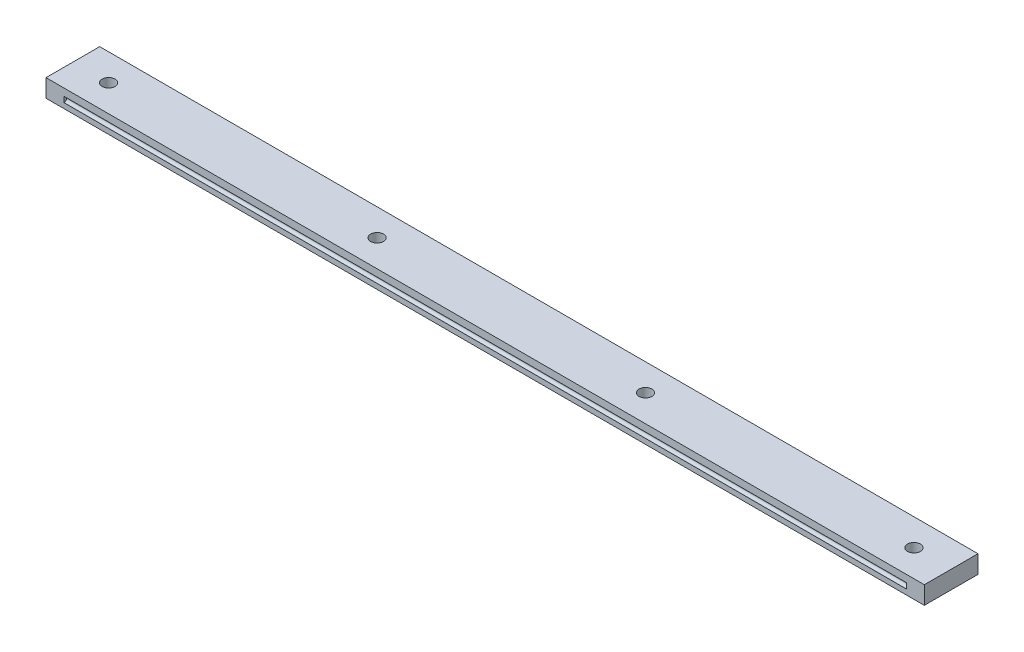
ISO-10303-21;
HEADER;
FILE_DESCRIPTION(('STEP AP214'),'2;1');
FILE_NAME('part.step','',(''),(''),'','','');
FILE_SCHEMA(('AUTOMOTIVE_DESIGN { 1 0 10303 214 1 1 1 1 }'));
ENDSEC;
DATA;
#1=APPLICATION_CONTEXT('core data for automotive mechanical design processes');
#2=APPLICATION_PROTOCOL_DEFINITION('international standard','automotive_design',2000,#1);
#3=PRODUCT_CONTEXT('',#1,'mechanical');
#4=PRODUCT('Part','Part','',(#3));
#5=PRODUCT_RELATED_PRODUCT_CATEGORY('part','',(#4));
#6=PRODUCT_DEFINITION_FORMATION('','',#4);
#7=PRODUCT_DEFINITION_CONTEXT('part definition',#1,'design');
#8=PRODUCT_DEFINITION('design','',#6,#7);
#9=PRODUCT_DEFINITION_SHAPE('','',#8);
#10=(LENGTH_UNIT() NAMED_UNIT(*) SI_UNIT(.MILLI.,.METRE.));
#11=(NAMED_UNIT(*) PLANE_ANGLE_UNIT() SI_UNIT($,.RADIAN.));
#12=(NAMED_UNIT(*) SI_UNIT($,.STERADIAN.) SOLID_ANGLE_UNIT());
#13=UNCERTAINTY_MEASURE_WITH_UNIT(LENGTH_MEASURE(1.E-05),#10,'distance_accuracy_value','');
#14=(GEOMETRIC_REPRESENTATION_CONTEXT(3) GLOBAL_UNCERTAINTY_ASSIGNED_CONTEXT((#13)) GLOBAL_UNIT_ASSIGNED_CONTEXT((#10,
#11,#12)) REPRESENTATION_CONTEXT('',''));
#15=CARTESIAN_POINT('',(0.,0.,0.));
#16=DIRECTION('',(0.,0.,1.));
#17=DIRECTION('',(1.,0.,0.));
#18=AXIS2_PLACEMENT_3D('',#15,#16,#17);
#19=CARTESIAN_POINT('',(235.,5.,7.5));
#20=DIRECTION('',(0.,-1.,0.));
#21=DIRECTION('',(0.,0.,-1.));
#22=AXIS2_PLACEMENT_3D('',#19,#20,#21);
#23=CYLINDRICAL_SURFACE('',#22,1.80000000000001);
#24=CARTESIAN_POINT('',(235.,5.,7.5));
#25=DIRECTION('',(0.,-1.,0.));
#26=DIRECTION('',(0.,0.,-1.));
#27=AXIS2_PLACEMENT_3D('',#24,#25,#26);
#28=CIRCLE('',#27,1.80000000000001);
#29=CARTESIAN_POINT('',(235.,5.,5.69999999999999));
#30=VERTEX_POINT('',#29);
#31=EDGE_CURVE('E184',#30,#30,#28,.T.);
#32=ORIENTED_EDGE('',*,*,#31,.F.);
#33=EDGE_LOOP('',(#32));
#34=FACE_BOUND('',#33,.T.);
#35=CARTESIAN_POINT('',(235.,2.,7.5));
#36=DIRECTION('',(0.,-1.,0.));
#37=DIRECTION('',(0.,0.,-1.));
#38=AXIS2_PLACEMENT_3D('',#35,#36,#37);
#39=CIRCLE('',#38,1.80000000000001);
#40=CARTESIAN_POINT('',(235.,2.,5.69999999999999));
#41=VERTEX_POINT('',#40);
#42=EDGE_CURVE('E187',#41,#41,#39,.F.);
#43=ORIENTED_EDGE('',*,*,#42,.F.);
#44=EDGE_LOOP('',(#43));
#45=FACE_BOUND('',#44,.T.);
#46=ADVANCED_FACE('F39',(#34,#45),#23,.F.);
#47=CARTESIAN_POINT('',(160.,5.,7.5));
#48=DIRECTION('',(0.,-1.,0.));
#49=DIRECTION('',(0.,0.,-1.));
#50=AXIS2_PLACEMENT_3D('',#47,#48,#49);
#51=CYLINDRICAL_SURFACE('',#50,1.79999999999998);
#52=CARTESIAN_POINT('',(160.,5.,7.5));
#53=DIRECTION('',(0.,-1.,0.));
#54=DIRECTION('',(0.,0.,-1.));
#55=AXIS2_PLACEMENT_3D('',#52,#53,#54);
#56=CIRCLE('',#55,1.79999999999998);
#57=CARTESIAN_POINT('',(160.,5.,5.70000000000002));
#58=VERTEX_POINT('',#57);
#59=EDGE_CURVE('E181',#58,#58,#56,.T.);
#60=ORIENTED_EDGE('',*,*,#59,.F.);
#61=EDGE_LOOP('',(#60));
#62=FACE_BOUND('',#61,.T.);
#63=CARTESIAN_POINT('',(160.,2.,7.5));
#64=DIRECTION('',(0.,-1.,0.));
#65=DIRECTION('',(0.,0.,-1.));
#66=AXIS2_PLACEMENT_3D('',#63,#64,#65);
#67=CIRCLE('',#66,1.79999999999998);
#68=CARTESIAN_POINT('',(160.,2.,5.70000000000002));
#69=VERTEX_POINT('',#68);
#70=EDGE_CURVE('E223',#69,#69,#67,.F.);
#71=ORIENTED_EDGE('',*,*,#70,.F.);
#72=EDGE_LOOP('',(#71));
#73=FACE_BOUND('',#72,.T.);
#74=ADVANCED_FACE('F257',(#62,#73),#51,.F.);
#75=CARTESIAN_POINT('',(85.,5.,7.5));
#76=DIRECTION('',(0.,-1.,0.));
#77=DIRECTION('',(0.,0.,-1.));
#78=AXIS2_PLACEMENT_3D('',#75,#76,#77);
#79=CYLINDRICAL_SURFACE('',#78,1.80000000000001);
#80=CARTESIAN_POINT('',(85.,5.,7.5));
#81=DIRECTION('',(0.,-1.,0.));
#82=DIRECTION('',(0.,0.,-1.));
#83=AXIS2_PLACEMENT_3D('',#80,#81,#82);
#84=CIRCLE('',#83,1.80000000000001);
#85=CARTESIAN_POINT('',(85.,5.,5.69999999999999));
#86=VERTEX_POINT('',#85);
#87=EDGE_CURVE('E178',#86,#86,#84,.T.);
#88=ORIENTED_EDGE('',*,*,#87,.F.);
#89=EDGE_LOOP('',(#88));
#90=FACE_BOUND('',#89,.T.);
#91=CARTESIAN_POINT('',(85.,2.,7.5));
#92=DIRECTION('',(0.,-1.,0.));
#93=DIRECTION('',(0.,0.,-1.));
#94=AXIS2_PLACEMENT_3D('',#91,#92,#93);
#95=CIRCLE('',#94,1.80000000000001);
#96=CARTESIAN_POINT('',(85.,2.,5.69999999999999));
#97=VERTEX_POINT('',#96);
#98=EDGE_CURVE('E220',#97,#97,#95,.F.);
#99=ORIENTED_EDGE('',*,*,#98,.F.);
#100=EDGE_LOOP('',(#99));
#101=FACE_BOUND('',#100,.T.);
#102=ADVANCED_FACE('F264',(#90,#101),#79,.F.);
#103=CARTESIAN_POINT('',(10.,5.,7.5));
#104=DIRECTION('',(0.,-1.,0.));
#105=DIRECTION('',(0.,0.,-1.));
#106=AXIS2_PLACEMENT_3D('',#103,#104,#105);
#107=CYLINDRICAL_SURFACE('',#106,1.8);
#108=CARTESIAN_POINT('',(10.,5.,7.5));
#109=DIRECTION('',(0.,-1.,0.));
#110=DIRECTION('',(0.,0.,-1.));
#111=AXIS2_PLACEMENT_3D('',#108,#109,#110);
#112=CIRCLE('',#111,1.8);
#113=CARTESIAN_POINT('',(10.,5.,5.7));
#114=VERTEX_POINT('',#113);
#115=EDGE_CURVE('E174',#114,#114,#112,.T.);
#116=ORIENTED_EDGE('',*,*,#115,.F.);
#117=EDGE_LOOP('',(#116));
#118=FACE_BOUND('',#117,.T.);
#119=CARTESIAN_POINT('',(10.,2.,7.5));
#120=DIRECTION('',(0.,-1.,0.));
#121=DIRECTION('',(0.,0.,-1.));
#122=AXIS2_PLACEMENT_3D('',#119,#120,#121);
#123=CIRCLE('',#122,1.8);
#124=CARTESIAN_POINT('',(10.,2.,5.7));
#125=VERTEX_POINT('',#124);
#126=EDGE_CURVE('E153',#125,#125,#123,.F.);
#127=ORIENTED_EDGE('',*,*,#126,.F.);
#128=EDGE_LOOP('',(#127));
#129=FACE_BOUND('',#128,.T.);
#130=ADVANCED_FACE('F290',(#118,#129),#107,.F.);
#131=CARTESIAN_POINT('',(0.,0.,15.));
#132=DIRECTION('',(1.,0.,0.));
#133=DIRECTION('',(0.,0.,-1.));
#134=AXIS2_PLACEMENT_3D('',#131,#132,#133);
#135=PLANE('',#134);
#136=DIRECTION('',(0.,-1.,0.));
#137=VECTOR('',#136,1.);
#138=CARTESIAN_POINT('',(0.,0.,0.));
#139=LINE('',#138,#137);
#140=CARTESIAN_POINT('',(0.,5.,0.));
#141=VERTEX_POINT('',#140);
#142=CARTESIAN_POINT('',(0.,0.,0.));
#143=VERTEX_POINT('',#142);
#144=EDGE_CURVE('E177',#141,#143,#139,.T.);
#145=ORIENTED_EDGE('',*,*,#144,.T.);
#146=DIRECTION('',(0.,0.,-1.));
#147=VECTOR('',#146,1.);
#148=CARTESIAN_POINT('',(0.,0.,15.));
#149=LINE('',#148,#147);
#150=CARTESIAN_POINT('',(0.,0.,15.));
#151=VERTEX_POINT('',#150);
#152=EDGE_CURVE('E214',#151,#143,#149,.T.);
#153=ORIENTED_EDGE('',*,*,#152,.F.);
#154=DIRECTION('',(0.,-1.,0.));
#155=VECTOR('',#154,1.);
#156=CARTESIAN_POINT('',(0.,0.,15.));
#157=LINE('',#156,#155);
#158=CARTESIAN_POINT('',(0.,5.,15.));
#159=VERTEX_POINT('',#158);
#160=EDGE_CURVE('E188',#159,#151,#157,.T.);
#161=ORIENTED_EDGE('',*,*,#160,.F.);
#162=DIRECTION('',(0.,0.,-1.));
#163=VECTOR('',#162,1.);
#164=CARTESIAN_POINT('',(0.,5.,15.));
#165=LINE('',#164,#163);
#166=EDGE_CURVE('E198',#159,#141,#165,.T.);
#167=ORIENTED_EDGE('',*,*,#166,.T.);
#168=EDGE_LOOP('',(#145,#153,#161,#167));
#169=FACE_BOUND('',#168,.T.);
#170=ADVANCED_FACE('F287',(#169),#135,.F.);
#171=CARTESIAN_POINT('',(0.,0.,15.));
#172=DIRECTION('',(0.,1.,0.));
#173=DIRECTION('',(0.,0.,1.));
#174=AXIS2_PLACEMENT_3D('',#171,#172,#173);
#175=PLANE('',#174);
#176=CARTESIAN_POINT('',(10.,0.,7.5));
#177=DIRECTION('',(0.,-1.,0.));
#178=DIRECTION('',(0.,0.,-1.));
#179=AXIS2_PLACEMENT_3D('',#176,#177,#178);
#180=CIRCLE('',#179,3.);
#181=CARTESIAN_POINT('',(10.,0.,4.5));
#182=VERTEX_POINT('',#181);
#183=EDGE_CURVE('E154',#182,#182,#180,.T.);
#184=ORIENTED_EDGE('',*,*,#183,.F.);
#185=EDGE_LOOP('',(#184));
#186=FACE_BOUND('',#185,.T.);
#187=CARTESIAN_POINT('',(85.,0.,7.5));
#188=DIRECTION('',(0.,-1.,0.));
#189=DIRECTION('',(0.,0.,-1.));
#190=AXIS2_PLACEMENT_3D('',#187,#188,#189);
#191=CIRCLE('',#190,3.00000000000001);
#192=CARTESIAN_POINT('',(85.,0.,4.49999999999999));
#193=VERTEX_POINT('',#192);
#194=EDGE_CURVE('E157',#193,#193,#191,.T.);
#195=ORIENTED_EDGE('',*,*,#194,.F.);
#196=EDGE_LOOP('',(#195));
#197=FACE_BOUND('',#196,.T.);
#198=CARTESIAN_POINT('',(160.,0.,7.5));
#199=DIRECTION('',(0.,-1.,0.));
#200=DIRECTION('',(0.,0.,-1.));
#201=AXIS2_PLACEMENT_3D('',#198,#199,#200);
#202=CIRCLE('',#201,2.99999999999999);
#203=CARTESIAN_POINT('',(160.,0.,4.50000000000001));
#204=VERTEX_POINT('',#203);
#205=EDGE_CURVE('E163',#204,#204,#202,.T.);
#206=ORIENTED_EDGE('',*,*,#205,.F.);
#207=EDGE_LOOP('',(#206));
#208=FACE_BOUND('',#207,.T.);
#209=CARTESIAN_POINT('',(235.,0.,7.5));
#210=DIRECTION('',(0.,-1.,0.));
#211=DIRECTION('',(0.,0.,-1.));
#212=AXIS2_PLACEMENT_3D('',#209,#210,#211);
#213=CIRCLE('',#212,2.99999999999999);
#214=CARTESIAN_POINT('',(235.,0.,4.50000000000001));
#215=VERTEX_POINT('',#214);
#216=EDGE_CURVE('E169',#215,#215,#213,.T.);
#217=ORIENTED_EDGE('',*,*,#216,.F.);
#218=EDGE_LOOP('',(#217));
#219=FACE_BOUND('',#218,.T.);
#220=DIRECTION('',(1.,0.,0.));
#221=VECTOR('',#220,1.);
#222=CARTESIAN_POINT('',(0.,0.,0.));
#223=LINE('',#222,#221);
#224=CARTESIAN_POINT('',(245.4,0.,0.));
#225=VERTEX_POINT('',#224);
#226=EDGE_CURVE('E201',#143,#225,#223,.T.);
#227=ORIENTED_EDGE('',*,*,#226,.T.);
#228=DIRECTION('',(0.,0.,-1.));
#229=VECTOR('',#228,1.);
#230=CARTESIAN_POINT('',(245.4,0.,15.));
#231=LINE('',#230,#229);
#232=CARTESIAN_POINT('',(245.4,0.,15.));
#233=VERTEX_POINT('',#232);
#234=EDGE_CURVE('E211',#233,#225,#231,.T.);
#235=ORIENTED_EDGE('',*,*,#234,.F.);
#236=DIRECTION('',(1.,0.,0.));
#237=VECTOR('',#236,1.);
#238=CARTESIAN_POINT('',(0.,0.,15.));
#239=LINE('',#238,#237);
#240=EDGE_CURVE('E191',#151,#233,#239,.T.);
#241=ORIENTED_EDGE('',*,*,#240,.F.);
#242=ORIENTED_EDGE('',*,*,#152,.T.);
#243=EDGE_LOOP('',(#227,#235,#241,#242));
#244=FACE_BOUND('',#243,.T.);
#245=ADVANCED_FACE('F284',(#186,#197,#208,#219,#244),#175,.F.);
#246=CARTESIAN_POINT('',(245.4,0.,15.));
#247=DIRECTION('',(-1.,0.,0.));
#248=DIRECTION('',(0.,0.,1.));
#249=AXIS2_PLACEMENT_3D('',#246,#247,#248);
#250=PLANE('',#249);
#251=DIRECTION('',(0.,1.,0.));
#252=VECTOR('',#251,1.);
#253=CARTESIAN_POINT('',(245.4,0.,0.));
#254=LINE('',#253,#252);
#255=CARTESIAN_POINT('',(245.4,5.,0.));
#256=VERTEX_POINT('',#255);
#257=EDGE_CURVE('E203',#225,#256,#254,.T.);
#258=ORIENTED_EDGE('',*,*,#257,.T.);
#259=DIRECTION('',(0.,0.,-1.));
#260=VECTOR('',#259,1.);
#261=CARTESIAN_POINT('',(245.4,5.,15.));
#262=LINE('',#261,#260);
#263=CARTESIAN_POINT('',(245.4,5.,15.));
#264=VERTEX_POINT('',#263);
#265=EDGE_CURVE('E208',#264,#256,#262,.T.);
#266=ORIENTED_EDGE('',*,*,#265,.F.);
#267=DIRECTION('',(0.,1.,0.));
#268=VECTOR('',#267,1.);
#269=CARTESIAN_POINT('',(245.4,0.,15.));
#270=LINE('',#269,#268);
#271=EDGE_CURVE('E194',#233,#264,#270,.T.);
#272=ORIENTED_EDGE('',*,*,#271,.F.);
#273=ORIENTED_EDGE('',*,*,#234,.T.);
#274=EDGE_LOOP('',(#258,#266,#272,#273));
#275=FACE_BOUND('',#274,.T.);
#276=ADVANCED_FACE('F280',(#275),#250,.F.);
#277=CARTESIAN_POINT('',(0.,5.,15.));
#278=DIRECTION('',(0.,-1.,0.));
#279=DIRECTION('',(0.,0.,-1.));
#280=AXIS2_PLACEMENT_3D('',#277,#278,#279);
#281=PLANE('',#280);
#282=ORIENTED_EDGE('',*,*,#115,.T.);
#283=EDGE_LOOP('',(#282));
#284=FACE_BOUND('',#283,.T.);
#285=ORIENTED_EDGE('',*,*,#87,.T.);
#286=EDGE_LOOP('',(#285));
#287=FACE_BOUND('',#286,.T.);
#288=ORIENTED_EDGE('',*,*,#59,.T.);
#289=EDGE_LOOP('',(#288));
#290=FACE_BOUND('',#289,.T.);
#291=ORIENTED_EDGE('',*,*,#31,.T.);
#292=EDGE_LOOP('',(#291));
#293=FACE_BOUND('',#292,.T.);
#294=DIRECTION('',(-1.,0.,0.));
#295=VECTOR('',#294,1.);
#296=CARTESIAN_POINT('',(0.,5.,0.));
#297=LINE('',#296,#295);
#298=EDGE_CURVE('E192',#256,#141,#297,.T.);
#299=ORIENTED_EDGE('',*,*,#298,.T.);
#300=ORIENTED_EDGE('',*,*,#166,.F.);
#301=DIRECTION('',(-1.,0.,0.));
#302=VECTOR('',#301,1.);
#303=CARTESIAN_POINT('',(0.,5.,15.));
#304=LINE('',#303,#302);
#305=EDGE_CURVE('E196',#264,#159,#304,.T.);
#306=ORIENTED_EDGE('',*,*,#305,.F.);
#307=ORIENTED_EDGE('',*,*,#265,.T.);
#308=EDGE_LOOP('',(#299,#300,#306,#307));
#309=FACE_BOUND('',#308,.T.);
#310=ADVANCED_FACE('F274',(#284,#287,#290,#293,#309),#281,.F.);
#311=CARTESIAN_POINT('',(0.,0.,15.));
#312=DIRECTION('',(0.,0.,-1.));
#313=DIRECTION('',(-1.,0.,0.));
#314=AXIS2_PLACEMENT_3D('',#311,#312,#313);
#315=PLANE('',#314);
#316=DIRECTION('',(1.,0.,0.));
#317=VECTOR('',#316,1.);
#318=CARTESIAN_POINT('',(5.,1.45,15.));
#319=LINE('',#318,#317);
#320=CARTESIAN_POINT('',(5.,1.45,15.));
#321=VERTEX_POINT('',#320);
#322=CARTESIAN_POINT('',(240.4,1.45,15.));
#323=VERTEX_POINT('',#322);
#324=EDGE_CURVE('E128',#321,#323,#319,.T.);
#325=ORIENTED_EDGE('',*,*,#324,.F.);
#326=DIRECTION('',(0.,-1.,0.));
#327=VECTOR('',#326,1.);
#328=CARTESIAN_POINT('',(5.,3.,15.));
#329=LINE('',#328,#327);
#330=CARTESIAN_POINT('',(5.,3.,15.));
#331=VERTEX_POINT('',#330);
#332=EDGE_CURVE('E133',#331,#321,#329,.T.);
#333=ORIENTED_EDGE('',*,*,#332,.F.);
#334=DIRECTION('',(-1.,0.,0.));
#335=VECTOR('',#334,1.);
#336=CARTESIAN_POINT('',(5.,3.,15.));
#337=LINE('',#336,#335);
#338=CARTESIAN_POINT('',(240.4,3.,15.));
#339=VERTEX_POINT('',#338);
#340=EDGE_CURVE('E138',#339,#331,#337,.T.);
#341=ORIENTED_EDGE('',*,*,#340,.F.);
#342=DIRECTION('',(0.,1.,0.));
#343=VECTOR('',#342,1.);
#344=CARTESIAN_POINT('',(240.4,3.,15.));
#345=LINE('',#344,#343);
#346=EDGE_CURVE('E121',#323,#339,#345,.T.);
#347=ORIENTED_EDGE('',*,*,#346,.F.);
#348=EDGE_LOOP('',(#325,#333,#341,#347));
#349=FACE_BOUND('',#348,.T.);
#350=ORIENTED_EDGE('',*,*,#160,.T.);
#351=ORIENTED_EDGE('',*,*,#240,.T.);
#352=ORIENTED_EDGE('',*,*,#271,.T.);
#353=ORIENTED_EDGE('',*,*,#305,.T.);
#354=EDGE_LOOP('',(#350,#351,#352,#353));
#355=FACE_BOUND('',#354,.T.);
#356=ADVANCED_FACE('F135',(#349,#355),#315,.F.);
#357=CARTESIAN_POINT('',(0.,0.,0.));
#358=DIRECTION('',(0.,0.,-1.));
#359=DIRECTION('',(-1.,0.,0.));
#360=AXIS2_PLACEMENT_3D('',#357,#358,#359);
#361=PLANE('',#360);
#362=ORIENTED_EDGE('',*,*,#144,.F.);
#363=ORIENTED_EDGE('',*,*,#298,.F.);
#364=ORIENTED_EDGE('',*,*,#257,.F.);
#365=ORIENTED_EDGE('',*,*,#226,.F.);
#366=EDGE_LOOP('',(#362,#363,#364,#365));
#367=FACE_BOUND('',#366,.T.);
#368=ADVANCED_FACE('F273',(#367),#361,.T.);
#369=CARTESIAN_POINT('',(10.,2.,7.5));
#370=DIRECTION('',(0.,-1.,0.));
#371=DIRECTION('',(0.,0.,-1.));
#372=AXIS2_PLACEMENT_3D('',#369,#370,#371);
#373=PLANE('',#372);
#374=CARTESIAN_POINT('',(10.,2.,7.5));
#375=DIRECTION('',(0.,-1.,0.));
#376=DIRECTION('',(0.,0.,-1.));
#377=AXIS2_PLACEMENT_3D('',#374,#375,#376);
#378=CIRCLE('',#377,3.);
#379=CARTESIAN_POINT('',(10.,2.,4.5));
#380=VERTEX_POINT('',#379);
#381=EDGE_CURVE('E150',#380,#380,#378,.T.);
#382=ORIENTED_EDGE('',*,*,#381,.T.);
#383=EDGE_LOOP('',(#382));
#384=FACE_BOUND('',#383,.T.);
#385=ORIENTED_EDGE('',*,*,#126,.T.);
#386=EDGE_LOOP('',(#385));
#387=FACE_BOUND('',#386,.T.);
#388=ADVANCED_FACE('F277',(#384,#387),#373,.T.);
#389=CARTESIAN_POINT('',(10.,2.,7.5));
#390=DIRECTION('',(0.,-1.,0.));
#391=DIRECTION('',(0.,0.,-1.));
#392=AXIS2_PLACEMENT_3D('',#389,#390,#391);
#393=CYLINDRICAL_SURFACE('',#392,3.);
#394=ORIENTED_EDGE('',*,*,#381,.F.);
#395=EDGE_LOOP('',(#394));
#396=FACE_BOUND('',#395,.T.);
#397=ORIENTED_EDGE('',*,*,#183,.T.);
#398=EDGE_LOOP('',(#397));
#399=FACE_BOUND('',#398,.T.);
#400=ADVANCED_FACE('F336',(#396,#399),#393,.F.);
#401=CARTESIAN_POINT('',(85.,2.,7.5));
#402=DIRECTION('',(0.,-1.,0.));
#403=DIRECTION('',(0.,0.,-1.));
#404=AXIS2_PLACEMENT_3D('',#401,#402,#403);
#405=PLANE('',#404);
#406=CARTESIAN_POINT('',(85.,2.,7.5));
#407=DIRECTION('',(0.,-1.,0.));
#408=DIRECTION('',(0.,0.,-1.));
#409=AXIS2_PLACEMENT_3D('',#406,#407,#408);
#410=CIRCLE('',#409,3.00000000000001);
#411=CARTESIAN_POINT('',(85.,2.,4.49999999999999));
#412=VERTEX_POINT('',#411);
#413=EDGE_CURVE('E160',#412,#412,#410,.T.);
#414=ORIENTED_EDGE('',*,*,#413,.T.);
#415=EDGE_LOOP('',(#414));
#416=FACE_BOUND('',#415,.T.);
#417=ORIENTED_EDGE('',*,*,#98,.T.);
#418=EDGE_LOOP('',(#417));
#419=FACE_BOUND('',#418,.T.);
#420=ADVANCED_FACE('F333',(#416,#419),#405,.T.);
#421=CARTESIAN_POINT('',(85.,2.,7.5));
#422=DIRECTION('',(0.,-1.,0.));
#423=DIRECTION('',(0.,0.,-1.));
#424=AXIS2_PLACEMENT_3D('',#421,#422,#423);
#425=CYLINDRICAL_SURFACE('',#424,3.00000000000001);
#426=ORIENTED_EDGE('',*,*,#413,.F.);
#427=EDGE_LOOP('',(#426));
#428=FACE_BOUND('',#427,.T.);
#429=ORIENTED_EDGE('',*,*,#194,.T.);
#430=EDGE_LOOP('',(#429));
#431=FACE_BOUND('',#430,.T.);
#432=ADVANCED_FACE('F328',(#428,#431),#425,.F.);
#433=CARTESIAN_POINT('',(160.,2.,7.5));
#434=DIRECTION('',(0.,-1.,0.));
#435=DIRECTION('',(0.,0.,-1.));
#436=AXIS2_PLACEMENT_3D('',#433,#434,#435);
#437=PLANE('',#436);
#438=CARTESIAN_POINT('',(160.,2.,7.5));
#439=DIRECTION('',(0.,-1.,0.));
#440=DIRECTION('',(0.,0.,-1.));
#441=AXIS2_PLACEMENT_3D('',#438,#439,#440);
#442=CIRCLE('',#441,2.99999999999999);
#443=CARTESIAN_POINT('',(160.,2.,4.50000000000001));
#444=VERTEX_POINT('',#443);
#445=EDGE_CURVE('E166',#444,#444,#442,.T.);
#446=ORIENTED_EDGE('',*,*,#445,.T.);
#447=EDGE_LOOP('',(#446));
#448=FACE_BOUND('',#447,.T.);
#449=ORIENTED_EDGE('',*,*,#70,.T.);
#450=EDGE_LOOP('',(#449));
#451=FACE_BOUND('',#450,.T.);
#452=ADVANCED_FACE('F325',(#448,#451),#437,.T.);
#453=CARTESIAN_POINT('',(160.,2.,7.5));
#454=DIRECTION('',(0.,-1.,0.));
#455=DIRECTION('',(0.,0.,-1.));
#456=AXIS2_PLACEMENT_3D('',#453,#454,#455);
#457=CYLINDRICAL_SURFACE('',#456,2.99999999999999);
#458=ORIENTED_EDGE('',*,*,#445,.F.);
#459=EDGE_LOOP('',(#458));
#460=FACE_BOUND('',#459,.T.);
#461=ORIENTED_EDGE('',*,*,#205,.T.);
#462=EDGE_LOOP('',(#461));
#463=FACE_BOUND('',#462,.T.);
#464=ADVANCED_FACE('F320',(#460,#463),#457,.F.);
#465=CARTESIAN_POINT('',(235.,2.,7.5));
#466=DIRECTION('',(0.,-1.,0.));
#467=DIRECTION('',(0.,0.,-1.));
#468=AXIS2_PLACEMENT_3D('',#465,#466,#467);
#469=PLANE('',#468);
#470=CARTESIAN_POINT('',(235.,2.,7.5));
#471=DIRECTION('',(0.,-1.,0.));
#472=DIRECTION('',(0.,0.,-1.));
#473=AXIS2_PLACEMENT_3D('',#470,#471,#472);
#474=CIRCLE('',#473,2.99999999999999);
#475=CARTESIAN_POINT('',(235.,2.,4.50000000000001));
#476=VERTEX_POINT('',#475);
#477=EDGE_CURVE('E146',#476,#476,#474,.T.);
#478=ORIENTED_EDGE('',*,*,#477,.T.);
#479=EDGE_LOOP('',(#478));
#480=FACE_BOUND('',#479,.T.);
#481=ORIENTED_EDGE('',*,*,#42,.T.);
#482=EDGE_LOOP('',(#481));
#483=FACE_BOUND('',#482,.T.);
#484=ADVANCED_FACE('F316',(#480,#483),#469,.T.);
#485=CARTESIAN_POINT('',(235.,2.,7.5));
#486=DIRECTION('',(0.,-1.,0.));
#487=DIRECTION('',(0.,0.,-1.));
#488=AXIS2_PLACEMENT_3D('',#485,#486,#487);
#489=CYLINDRICAL_SURFACE('',#488,2.99999999999999);
#490=ORIENTED_EDGE('',*,*,#477,.F.);
#491=EDGE_LOOP('',(#490));
#492=FACE_BOUND('',#491,.T.);
#493=ORIENTED_EDGE('',*,*,#216,.T.);
#494=EDGE_LOOP('',(#493));
#495=FACE_BOUND('',#494,.T.);
#496=ADVANCED_FACE('F319',(#492,#495),#489,.F.);
#497=CARTESIAN_POINT('',(5.,3.,14.25));
#498=DIRECTION('',(-1.,0.,0.));
#499=DIRECTION('',(0.,-1.,0.));
#500=AXIS2_PLACEMENT_3D('',#497,#498,#499);
#501=PLANE('',#500);
#502=DIRECTION('',(0.,0.,1.));
#503=VECTOR('',#502,1.);
#504=CARTESIAN_POINT('',(5.,1.45,14.25));
#505=LINE('',#504,#503);
#506=CARTESIAN_POINT('',(5.,1.45,14.95));
#507=VERTEX_POINT('',#506);
#508=EDGE_CURVE('E125',#507,#321,#505,.T.);
#509=ORIENTED_EDGE('',*,*,#508,.F.);
#510=CARTESIAN_POINT('',(5.,2.15,14.95));
#511=DIRECTION('',(-1.,0.,0.));
#512=DIRECTION('',(0.,-1.,0.));
#513=AXIS2_PLACEMENT_3D('',#510,#511,#512);
#514=CIRCLE('',#513,0.7);
#515=CARTESIAN_POINT('',(5.,2.15,14.25));
#516=VERTEX_POINT('',#515);
#517=EDGE_CURVE('E47',#507,#516,#514,.F.);
#518=ORIENTED_EDGE('',*,*,#517,.T.);
#519=DIRECTION('',(0.,-1.,0.));
#520=VECTOR('',#519,1.);
#521=CARTESIAN_POINT('',(5.,3.,14.25));
#522=LINE('',#521,#520);
#523=CARTESIAN_POINT('',(5.,2.3,14.25));
#524=VERTEX_POINT('',#523);
#525=EDGE_CURVE('E140',#524,#516,#522,.T.);
#526=ORIENTED_EDGE('',*,*,#525,.F.);
#527=CARTESIAN_POINT('',(5.,2.3,14.95));
#528=DIRECTION('',(-1.,0.,0.));
#529=DIRECTION('',(0.,-1.,0.));
#530=AXIS2_PLACEMENT_3D('',#527,#528,#529);
#531=CIRCLE('',#530,0.7);
#532=CARTESIAN_POINT('',(5.,3.,14.95));
#533=VERTEX_POINT('',#532);
#534=EDGE_CURVE('E54',#524,#533,#531,.F.);
#535=ORIENTED_EDGE('',*,*,#534,.T.);
#536=DIRECTION('',(0.,0.,1.));
#537=VECTOR('',#536,1.);
#538=CARTESIAN_POINT('',(5.,3.,14.25));
#539=LINE('',#538,#537);
#540=EDGE_CURVE('E144',#533,#331,#539,.T.);
#541=ORIENTED_EDGE('',*,*,#540,.T.);
#542=ORIENTED_EDGE('',*,*,#332,.T.);
#543=EDGE_LOOP('',(#509,#518,#526,#535,#541,#542));
#544=FACE_BOUND('',#543,.T.);
#545=ADVANCED_FACE('F239',(#544),#501,.F.);
#546=CARTESIAN_POINT('',(5.,3.,14.25));
#547=DIRECTION('',(0.,1.,0.));
#548=DIRECTION('',(0.,0.,1.));
#549=AXIS2_PLACEMENT_3D('',#546,#547,#548);
#550=PLANE('',#549);
#551=ORIENTED_EDGE('',*,*,#540,.F.);
#552=DIRECTION('',(-1.,0.,0.));
#553=VECTOR('',#552,1.);
#554=CARTESIAN_POINT('',(5.,3.,14.95));
#555=LINE('',#554,#553);
#556=CARTESIAN_POINT('',(240.4,3.,14.95));
#557=VERTEX_POINT('',#556);
#558=EDGE_CURVE('E11',#533,#557,#555,.F.);
#559=ORIENTED_EDGE('',*,*,#558,.T.);
#560=DIRECTION('',(0.,0.,1.));
#561=VECTOR('',#560,1.);
#562=CARTESIAN_POINT('',(240.4,3.,14.25));
#563=LINE('',#562,#561);
#564=EDGE_CURVE('E124',#557,#339,#563,.T.);
#565=ORIENTED_EDGE('',*,*,#564,.T.);
#566=ORIENTED_EDGE('',*,*,#340,.T.);
#567=EDGE_LOOP('',(#551,#559,#565,#566));
#568=FACE_BOUND('',#567,.T.);
#569=ADVANCED_FACE('F349',(#568),#550,.F.);
#570=CARTESIAN_POINT('',(240.4,3.,14.25));
#571=DIRECTION('',(1.,0.,0.));
#572=DIRECTION('',(0.,0.,-1.));
#573=AXIS2_PLACEMENT_3D('',#570,#571,#572);
#574=PLANE('',#573);
#575=DIRECTION('',(0.,1.,0.));
#576=VECTOR('',#575,1.);
#577=CARTESIAN_POINT('',(240.4,3.,14.25));
#578=LINE('',#577,#576);
#579=CARTESIAN_POINT('',(240.4,2.15,14.25));
#580=VERTEX_POINT('',#579);
#581=CARTESIAN_POINT('',(240.4,2.3,14.25));
#582=VERTEX_POINT('',#581);
#583=EDGE_CURVE('E149',#580,#582,#578,.T.);
#584=ORIENTED_EDGE('',*,*,#583,.F.);
#585=CARTESIAN_POINT('',(240.4,2.15,14.95));
#586=DIRECTION('',(1.,0.,0.));
#587=DIRECTION('',(0.,0.,-1.));
#588=AXIS2_PLACEMENT_3D('',#585,#586,#587);
#589=CIRCLE('',#588,0.7);
#590=CARTESIAN_POINT('',(240.4,1.45,14.95));
#591=VERTEX_POINT('',#590);
#592=EDGE_CURVE('E123',#580,#591,#589,.F.);
#593=ORIENTED_EDGE('',*,*,#592,.T.);
#594=DIRECTION('',(0.,0.,1.));
#595=VECTOR('',#594,1.);
#596=CARTESIAN_POINT('',(240.4,1.45,14.25));
#597=LINE('',#596,#595);
#598=EDGE_CURVE('E115',#591,#323,#597,.T.);
#599=ORIENTED_EDGE('',*,*,#598,.T.);
#600=ORIENTED_EDGE('',*,*,#346,.T.);
#601=ORIENTED_EDGE('',*,*,#564,.F.);
#602=CARTESIAN_POINT('',(240.4,2.3,14.95));
#603=DIRECTION('',(1.,0.,0.));
#604=DIRECTION('',(0.,0.,-1.));
#605=AXIS2_PLACEMENT_3D('',#602,#603,#604);
#606=CIRCLE('',#605,0.7);
#607=EDGE_CURVE('E233',#557,#582,#606,.F.);
#608=ORIENTED_EDGE('',*,*,#607,.T.);
#609=EDGE_LOOP('',(#584,#593,#599,#600,#601,#608));
#610=FACE_BOUND('',#609,.T.);
#611=ADVANCED_FACE('F118',(#610),#574,.F.);
#612=CARTESIAN_POINT('',(5.,1.45,14.25));
#613=DIRECTION('',(0.,-1.,0.));
#614=DIRECTION('',(0.,0.,-1.));
#615=AXIS2_PLACEMENT_3D('',#612,#613,#614);
#616=PLANE('',#615);
#617=ORIENTED_EDGE('',*,*,#598,.F.);
#618=DIRECTION('',(1.,0.,0.));
#619=VECTOR('',#618,1.);
#620=CARTESIAN_POINT('',(5.,1.45,14.95));
#621=LINE('',#620,#619);
#622=EDGE_CURVE('E62',#591,#507,#621,.F.);
#623=ORIENTED_EDGE('',*,*,#622,.T.);
#624=ORIENTED_EDGE('',*,*,#508,.T.);
#625=ORIENTED_EDGE('',*,*,#324,.T.);
#626=EDGE_LOOP('',(#617,#623,#624,#625));
#627=FACE_BOUND('',#626,.T.);
#628=ADVANCED_FACE('F129',(#627),#616,.F.);
#629=CARTESIAN_POINT('',(0.,0.,14.25));
#630=DIRECTION('',(0.,0.,1.));
#631=DIRECTION('',(1.,0.,0.));
#632=AXIS2_PLACEMENT_3D('',#629,#630,#631);
#633=PLANE('',#632);
#634=ORIENTED_EDGE('',*,*,#525,.T.);
#635=DIRECTION('',(1.,0.,0.));
#636=VECTOR('',#635,1.);
#637=CARTESIAN_POINT('',(0.,2.15,14.25));
#638=LINE('',#637,#636);
#639=EDGE_CURVE('E230',#516,#580,#638,.T.);
#640=ORIENTED_EDGE('',*,*,#639,.T.);
#641=ORIENTED_EDGE('',*,*,#583,.T.);
#642=DIRECTION('',(-1.,0.,0.));
#643=VECTOR('',#642,1.);
#644=CARTESIAN_POINT('',(0.,2.3,14.25));
#645=LINE('',#644,#643);
#646=EDGE_CURVE('E217',#582,#524,#645,.T.);
#647=ORIENTED_EDGE('',*,*,#646,.T.);
#648=EDGE_LOOP('',(#634,#640,#641,#647));
#649=FACE_BOUND('',#648,.T.);
#650=ADVANCED_FACE('F243',(#649),#633,.T.);
#651=CARTESIAN_POINT('',(0.,2.15,14.95));
#652=DIRECTION('',(1.,0.,0.));
#653=DIRECTION('',(0.,0.,-1.));
#654=AXIS2_PLACEMENT_3D('',#651,#652,#653);
#655=CYLINDRICAL_SURFACE('',#654,0.7);
#656=ORIENTED_EDGE('',*,*,#517,.F.);
#657=ORIENTED_EDGE('',*,*,#622,.F.);
#658=ORIENTED_EDGE('',*,*,#592,.F.);
#659=ORIENTED_EDGE('',*,*,#639,.F.);
#660=EDGE_LOOP('',(#656,#657,#658,#659));
#661=FACE_BOUND('',#660,.T.);
#662=ADVANCED_FACE('F247',(#661),#655,.F.);
#663=CARTESIAN_POINT('',(0.,2.3,14.95));
#664=DIRECTION('',(-1.,0.,0.));
#665=DIRECTION('',(0.,0.,1.));
#666=AXIS2_PLACEMENT_3D('',#663,#664,#665);
#667=CYLINDRICAL_SURFACE('',#666,0.7);
#668=ORIENTED_EDGE('',*,*,#607,.F.);
#669=ORIENTED_EDGE('',*,*,#558,.F.);
#670=ORIENTED_EDGE('',*,*,#534,.F.);
#671=ORIENTED_EDGE('',*,*,#646,.F.);
#672=EDGE_LOOP('',(#668,#669,#670,#671));
#673=FACE_BOUND('',#672,.T.);
#674=ADVANCED_FACE('F41',(#673),#667,.F.);
#675=CLOSED_SHELL('',(#46,#74,#102,#130,#170,#245,#276,#310,#356,#368,#388,#400,#420,#432,#452,
#464,#484,#496,#545,#569,#611,#628,#650,#662,#674));
#676=MANIFOLD_SOLID_BREP('B2',#675);
#677=ADVANCED_BREP_SHAPE_REPRESENTATION('',(#18,#676),#14);
#678=SHAPE_DEFINITION_REPRESENTATION(#9,#677);
ENDSEC;
END-ISO-10303-21;
